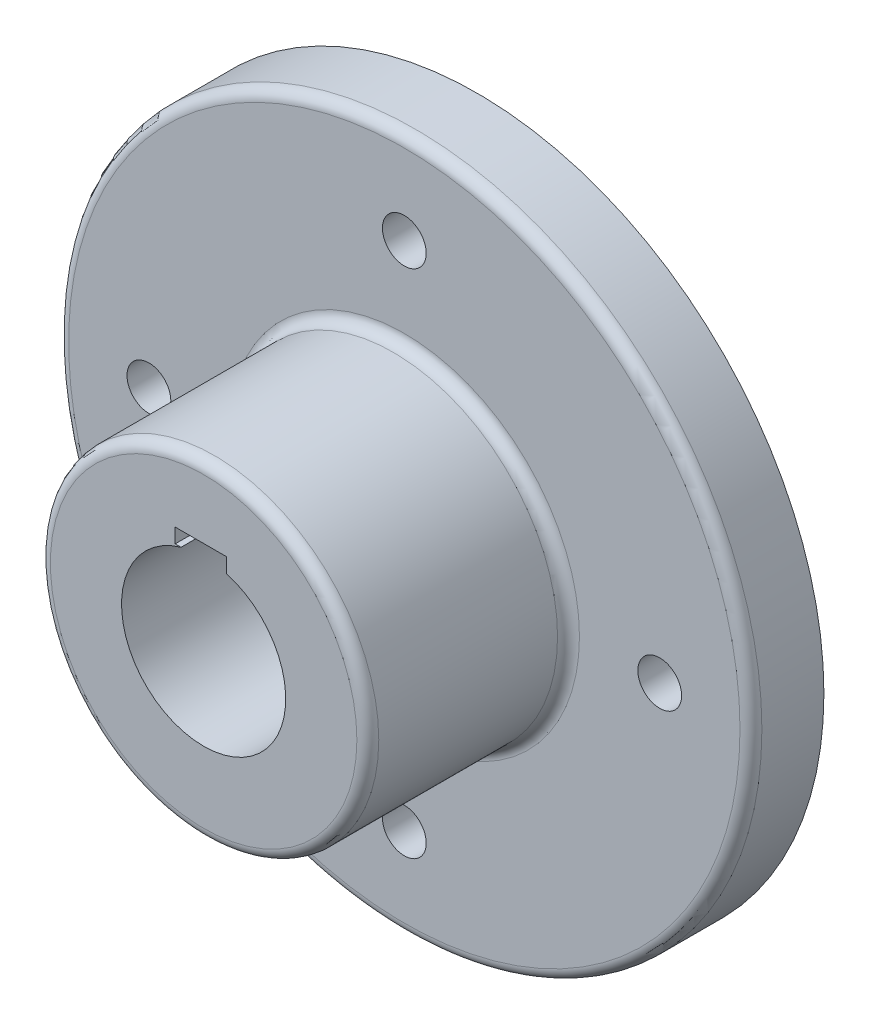
ISO-10303-21;
HEADER;
FILE_DESCRIPTION(('STEP AP214'),'2;1');
FILE_NAME('part.step','',(''),(''),'','','');
FILE_SCHEMA(('AUTOMOTIVE_DESIGN { 1 0 10303 214 1 1 1 1 }'));
ENDSEC;
DATA;
#1=APPLICATION_CONTEXT('core data for automotive mechanical design processes');
#2=APPLICATION_PROTOCOL_DEFINITION('international standard','automotive_design',2000,#1);
#3=PRODUCT_CONTEXT('',#1,'mechanical');
#4=PRODUCT('Part','Part','',(#3));
#5=PRODUCT_RELATED_PRODUCT_CATEGORY('part','',(#4));
#6=PRODUCT_DEFINITION_FORMATION('','',#4);
#7=PRODUCT_DEFINITION_CONTEXT('part definition',#1,'design');
#8=PRODUCT_DEFINITION('design','',#6,#7);
#9=PRODUCT_DEFINITION_SHAPE('','',#8);
#10=(LENGTH_UNIT() NAMED_UNIT(*) SI_UNIT(.MILLI.,.METRE.));
#11=(NAMED_UNIT(*) PLANE_ANGLE_UNIT() SI_UNIT($,.RADIAN.));
#12=(NAMED_UNIT(*) SI_UNIT($,.STERADIAN.) SOLID_ANGLE_UNIT());
#13=UNCERTAINTY_MEASURE_WITH_UNIT(LENGTH_MEASURE(1.E-05),#10,'distance_accuracy_value','');
#14=(GEOMETRIC_REPRESENTATION_CONTEXT(3) GLOBAL_UNCERTAINTY_ASSIGNED_CONTEXT((#13)) GLOBAL_UNIT_ASSIGNED_CONTEXT((#10,
#11,#12)) REPRESENTATION_CONTEXT('',''));
#15=CARTESIAN_POINT('',(0.,0.,0.));
#16=DIRECTION('',(0.,0.,1.));
#17=DIRECTION('',(1.,0.,0.));
#18=AXIS2_PLACEMENT_3D('',#15,#16,#17);
#19=CARTESIAN_POINT('',(0.,0.,20.));
#20=DIRECTION('',(0.,0.,-1.));
#21=DIRECTION('',(-1.,0.,0.));
#22=AXIS2_PLACEMENT_3D('',#19,#20,#21);
#23=CYLINDRICAL_SURFACE('',#22,95.);
#24=CARTESIAN_POINT('',(0.,0.,17.));
#25=DIRECTION('',(0.,0.,1.));
#26=DIRECTION('',(1.,0.,0.));
#27=AXIS2_PLACEMENT_3D('',#24,#25,#26);
#28=CIRCLE('',#27,95.);
#29=CARTESIAN_POINT('',(95.,0.,17.));
#30=VERTEX_POINT('',#29);
#31=EDGE_CURVE('E11',#30,#30,#28,.F.);
#32=ORIENTED_EDGE('',*,*,#31,.T.);
#33=EDGE_LOOP('',(#32));
#34=FACE_BOUND('',#33,.T.);
#35=CARTESIAN_POINT('',(0.,0.,0.));
#36=DIRECTION('',(0.,0.,1.));
#37=DIRECTION('',(1.,0.,0.));
#38=AXIS2_PLACEMENT_3D('',#35,#36,#37);
#39=CIRCLE('',#38,95.);
#40=CARTESIAN_POINT('',(95.,0.,0.));
#41=VERTEX_POINT('',#40);
#42=EDGE_CURVE('E172',#41,#41,#39,.T.);
#43=ORIENTED_EDGE('',*,*,#42,.T.);
#44=EDGE_LOOP('',(#43));
#45=FACE_BOUND('',#44,.T.);
#46=ADVANCED_FACE('F39',(#34,#45),#23,.T.);
#47=CARTESIAN_POINT('',(0.,0.,20.));
#48=DIRECTION('',(0.,0.,1.));
#49=DIRECTION('',(1.,0.,0.));
#50=AXIS2_PLACEMENT_3D('',#47,#48,#49);
#51=PLANE('',#50);
#52=CARTESIAN_POINT('',(0.,0.,20.));
#53=DIRECTION('',(0.,0.,1.));
#54=DIRECTION('',(1.,0.,0.));
#55=AXIS2_PLACEMENT_3D('',#52,#53,#54);
#56=CIRCLE('',#55,48.);
#57=CARTESIAN_POINT('',(48.,0.,20.));
#58=VERTEX_POINT('',#57);
#59=EDGE_CURVE('E48',#58,#58,#56,.F.);
#60=ORIENTED_EDGE('',*,*,#59,.T.);
#61=EDGE_LOOP('',(#60));
#62=FACE_BOUND('',#61,.T.);
#63=CARTESIAN_POINT('',(0.,0.,20.));
#64=DIRECTION('',(0.,0.,1.));
#65=DIRECTION('',(1.,0.,0.));
#66=AXIS2_PLACEMENT_3D('',#63,#64,#65);
#67=CIRCLE('',#66,92.);
#68=CARTESIAN_POINT('',(92.,0.,20.));
#69=VERTEX_POINT('',#68);
#70=EDGE_CURVE('E190',#69,#69,#67,.T.);
#71=ORIENTED_EDGE('',*,*,#70,.T.);
#72=EDGE_LOOP('',(#71));
#73=FACE_BOUND('',#72,.T.);
#74=CARTESIAN_POINT('',(0.,70.,20.));
#75=DIRECTION('',(0.,0.,1.));
#76=DIRECTION('',(1.,0.,0.));
#77=AXIS2_PLACEMENT_3D('',#74,#75,#76);
#78=CIRCLE('',#77,6.);
#79=CARTESIAN_POINT('',(6.,70.,20.));
#80=VERTEX_POINT('',#79);
#81=EDGE_CURVE('E139',#80,#80,#78,.F.);
#82=ORIENTED_EDGE('',*,*,#81,.T.);
#83=EDGE_LOOP('',(#82));
#84=FACE_BOUND('',#83,.T.);
#85=CARTESIAN_POINT('',(-70.000000000002,1.97666086873723E-12,20.));
#86=DIRECTION('',(0.,0.,1.));
#87=DIRECTION('',(1.,0.,0.));
#88=AXIS2_PLACEMENT_3D('',#85,#86,#87);
#89=CIRCLE('',#88,6.00000000000155);
#90=CARTESIAN_POINT('',(-64.0000000000004,1.97666086873723E-12,20.));
#91=VERTEX_POINT('',#90);
#92=EDGE_CURVE('E140',#91,#91,#89,.F.);
#93=ORIENTED_EDGE('',*,*,#92,.T.);
#94=EDGE_LOOP('',(#93));
#95=FACE_BOUND('',#94,.T.);
#96=CARTESIAN_POINT('',(-3.95332173747447E-12,-70.,20.));
#97=DIRECTION('',(0.,0.,1.));
#98=DIRECTION('',(1.,0.,0.));
#99=AXIS2_PLACEMENT_3D('',#96,#97,#98);
#100=CIRCLE('',#99,6.00000000000425);
#101=CARTESIAN_POINT('',(6.0000000000003,-70.,20.));
#102=VERTEX_POINT('',#101);
#103=EDGE_CURVE('E149',#102,#102,#100,.F.);
#104=ORIENTED_EDGE('',*,*,#103,.T.);
#105=EDGE_LOOP('',(#104));
#106=FACE_BOUND('',#105,.T.);
#107=CARTESIAN_POINT('',(69.999999999998,-1.98523339633126E-12,20.));
#108=DIRECTION('',(0.,0.,1.));
#109=DIRECTION('',(1.,0.,0.));
#110=AXIS2_PLACEMENT_3D('',#107,#108,#109);
#111=CIRCLE('',#110,6.00000000000318);
#112=CARTESIAN_POINT('',(76.0000000000012,-1.98523339633126E-12,20.));
#113=VERTEX_POINT('',#112);
#114=EDGE_CURVE('E157',#113,#113,#111,.F.);
#115=ORIENTED_EDGE('',*,*,#114,.T.);
#116=EDGE_LOOP('',(#115));
#117=FACE_BOUND('',#116,.T.);
#118=ADVANCED_FACE('F197',(#62,#73,#84,#95,#106,#117),#51,.T.);
#119=CARTESIAN_POINT('',(0.,0.,0.));
#120=DIRECTION('',(0.,0.,1.));
#121=DIRECTION('',(1.,0.,0.));
#122=AXIS2_PLACEMENT_3D('',#119,#120,#121);
#123=PLANE('',#122);
#124=CARTESIAN_POINT('',(0.,70.,0.));
#125=DIRECTION('',(0.,0.,-1.));
#126=DIRECTION('',(-1.,0.,0.));
#127=AXIS2_PLACEMENT_3D('',#124,#125,#126);
#128=CIRCLE('',#127,6.);
#129=CARTESIAN_POINT('',(-6.,70.,0.));
#130=VERTEX_POINT('',#129);
#131=EDGE_CURVE('E135',#130,#130,#128,.T.);
#132=ORIENTED_EDGE('',*,*,#131,.F.);
#133=EDGE_LOOP('',(#132));
#134=FACE_BOUND('',#133,.T.);
#135=CARTESIAN_POINT('',(-70.000000000002,1.97666086873723E-12,0.));
#136=DIRECTION('',(0.,0.,-1.));
#137=DIRECTION('',(-1.,0.,0.));
#138=AXIS2_PLACEMENT_3D('',#135,#136,#137);
#139=CIRCLE('',#138,6.00000000000155);
#140=CARTESIAN_POINT('',(-76.0000000000035,1.97666086873723E-12,0.));
#141=VERTEX_POINT('',#140);
#142=EDGE_CURVE('E145',#141,#141,#139,.T.);
#143=ORIENTED_EDGE('',*,*,#142,.F.);
#144=EDGE_LOOP('',(#143));
#145=FACE_BOUND('',#144,.T.);
#146=CARTESIAN_POINT('',(-3.95332173747447E-12,-70.,0.));
#147=DIRECTION('',(0.,0.,-1.));
#148=DIRECTION('',(-1.,0.,0.));
#149=AXIS2_PLACEMENT_3D('',#146,#147,#148);
#150=CIRCLE('',#149,6.00000000000425);
#151=CARTESIAN_POINT('',(-6.0000000000082,-70.,0.));
#152=VERTEX_POINT('',#151);
#153=EDGE_CURVE('E153',#152,#152,#150,.T.);
#154=ORIENTED_EDGE('',*,*,#153,.F.);
#155=EDGE_LOOP('',(#154));
#156=FACE_BOUND('',#155,.T.);
#157=CARTESIAN_POINT('',(69.999999999998,-1.98523339633126E-12,0.));
#158=DIRECTION('',(0.,0.,-1.));
#159=DIRECTION('',(-1.,0.,0.));
#160=AXIS2_PLACEMENT_3D('',#157,#158,#159);
#161=CIRCLE('',#160,6.00000000000318);
#162=CARTESIAN_POINT('',(63.9999999999949,-1.98523339633126E-12,0.));
#163=VERTEX_POINT('',#162);
#164=EDGE_CURVE('E134',#163,#163,#161,.T.);
#165=ORIENTED_EDGE('',*,*,#164,.F.);
#166=EDGE_LOOP('',(#165));
#167=FACE_BOUND('',#166,.T.);
#168=DIRECTION('',(0.,1.,0.));
#169=VECTOR('',#168,1.);
#170=CARTESIAN_POINT('',(-7.8016616704134,21.6293920846606,0.));
#171=LINE('',#170,#169);
#172=CARTESIAN_POINT('',(-7.8016616704134,21.6293920846606,0.));
#173=VERTEX_POINT('',#172);
#174=CARTESIAN_POINT('',(-7.8016616704134,25.6293920846606,0.));
#175=VERTEX_POINT('',#174);
#176=EDGE_CURVE('E115',#173,#175,#171,.T.);
#177=ORIENTED_EDGE('',*,*,#176,.F.);
#178=DIRECTION('',(-1.,0.,0.));
#179=VECTOR('',#178,1.);
#180=CARTESIAN_POINT('',(6.1983383295866,21.6293920846606,0.));
#181=LINE('',#180,#179);
#182=CARTESIAN_POINT('',(-6.1983383295866,21.6293920846606,0.));
#183=VERTEX_POINT('',#182);
#184=EDGE_CURVE('E102',#183,#173,#181,.T.);
#185=ORIENTED_EDGE('',*,*,#184,.F.);
#186=CARTESIAN_POINT('',(0.,0.,0.));
#187=DIRECTION('',(0.,0.,-1.));
#188=DIRECTION('',(-1.,0.,0.));
#189=AXIS2_PLACEMENT_3D('',#186,#187,#188);
#190=CIRCLE('',#189,22.5);
#191=CARTESIAN_POINT('',(6.1983383295866,21.6293920846606,0.));
#192=VERTEX_POINT('',#191);
#193=EDGE_CURVE('E144',#192,#183,#190,.T.);
#194=ORIENTED_EDGE('',*,*,#193,.F.);
#195=DIRECTION('',(0.,-1.,0.));
#196=VECTOR('',#195,1.);
#197=CARTESIAN_POINT('',(6.1983383295866,21.6293920846606,0.));
#198=LINE('',#197,#196);
#199=CARTESIAN_POINT('',(6.1983383295866,25.6293920846606,0.));
#200=VERTEX_POINT('',#199);
#201=EDGE_CURVE('E55',#200,#192,#198,.T.);
#202=ORIENTED_EDGE('',*,*,#201,.F.);
#203=DIRECTION('',(1.,0.,0.));
#204=VECTOR('',#203,1.);
#205=CARTESIAN_POINT('',(6.1983383295866,25.6293920846606,0.));
#206=LINE('',#205,#204);
#207=EDGE_CURVE('E111',#175,#200,#206,.T.);
#208=ORIENTED_EDGE('',*,*,#207,.F.);
#209=EDGE_LOOP('',(#177,#185,#194,#202,#208));
#210=FACE_BOUND('',#209,.T.);
#211=ORIENTED_EDGE('',*,*,#42,.F.);
#212=EDGE_LOOP('',(#211));
#213=FACE_BOUND('',#212,.T.);
#214=ADVANCED_FACE('F208',(#134,#145,#156,#167,#210,#213),#123,.F.);
#215=CARTESIAN_POINT('',(0.,0.,75.));
#216=DIRECTION('',(0.,0.,-1.));
#217=DIRECTION('',(-1.,0.,0.));
#218=AXIS2_PLACEMENT_3D('',#215,#216,#217);
#219=CYLINDRICAL_SURFACE('',#218,45.);
#220=CARTESIAN_POINT('',(0.,0.,72.));
#221=DIRECTION('',(0.,0.,1.));
#222=DIRECTION('',(1.,0.,0.));
#223=AXIS2_PLACEMENT_3D('',#220,#221,#222);
#224=CIRCLE('',#223,45.);
#225=CARTESIAN_POINT('',(45.,0.,72.));
#226=VERTEX_POINT('',#225);
#227=EDGE_CURVE('E186',#226,#226,#224,.F.);
#228=ORIENTED_EDGE('',*,*,#227,.T.);
#229=EDGE_LOOP('',(#228));
#230=FACE_BOUND('',#229,.T.);
#231=CARTESIAN_POINT('',(0.,0.,23.));
#232=DIRECTION('',(0.,0.,1.));
#233=DIRECTION('',(1.,0.,0.));
#234=AXIS2_PLACEMENT_3D('',#231,#232,#233);
#235=CIRCLE('',#234,45.);
#236=CARTESIAN_POINT('',(45.,0.,23.));
#237=VERTEX_POINT('',#236);
#238=EDGE_CURVE('E182',#237,#237,#235,.T.);
#239=ORIENTED_EDGE('',*,*,#238,.T.);
#240=EDGE_LOOP('',(#239));
#241=FACE_BOUND('',#240,.T.);
#242=ADVANCED_FACE('F206',(#230,#241),#219,.T.);
#243=CARTESIAN_POINT('',(0.,0.,75.));
#244=DIRECTION('',(0.,0.,1.));
#245=DIRECTION('',(1.,0.,0.));
#246=AXIS2_PLACEMENT_3D('',#243,#244,#245);
#247=PLANE('',#246);
#248=CARTESIAN_POINT('',(0.,0.,75.));
#249=DIRECTION('',(0.,0.,1.));
#250=DIRECTION('',(1.,0.,0.));
#251=AXIS2_PLACEMENT_3D('',#248,#249,#250);
#252=CIRCLE('',#251,42.);
#253=CARTESIAN_POINT('',(42.,0.,75.));
#254=VERTEX_POINT('',#253);
#255=EDGE_CURVE('E178',#254,#254,#252,.T.);
#256=ORIENTED_EDGE('',*,*,#255,.T.);
#257=EDGE_LOOP('',(#256));
#258=FACE_BOUND('',#257,.T.);
#259=DIRECTION('',(-1.,0.,0.));
#260=VECTOR('',#259,1.);
#261=CARTESIAN_POINT('',(6.1983383295866,21.6293920846606,75.));
#262=LINE('',#261,#260);
#263=CARTESIAN_POINT('',(-6.1983383295866,21.6293920846606,75.));
#264=VERTEX_POINT('',#263);
#265=CARTESIAN_POINT('',(-7.8016616704134,21.6293920846606,75.));
#266=VERTEX_POINT('',#265);
#267=EDGE_CURVE('E101',#264,#266,#262,.T.);
#268=ORIENTED_EDGE('',*,*,#267,.T.);
#269=DIRECTION('',(0.,1.,0.));
#270=VECTOR('',#269,1.);
#271=CARTESIAN_POINT('',(-7.8016616704134,21.6293920846606,75.));
#272=LINE('',#271,#270);
#273=CARTESIAN_POINT('',(-7.8016616704134,25.6293920846606,75.));
#274=VERTEX_POINT('',#273);
#275=EDGE_CURVE('E88',#266,#274,#272,.T.);
#276=ORIENTED_EDGE('',*,*,#275,.T.);
#277=DIRECTION('',(1.,0.,0.));
#278=VECTOR('',#277,1.);
#279=CARTESIAN_POINT('',(6.1983383295866,25.6293920846606,75.));
#280=LINE('',#279,#278);
#281=CARTESIAN_POINT('',(6.1983383295866,25.6293920846606,75.));
#282=VERTEX_POINT('',#281);
#283=EDGE_CURVE('E125',#274,#282,#280,.T.);
#284=ORIENTED_EDGE('',*,*,#283,.T.);
#285=DIRECTION('',(0.,-1.,0.));
#286=VECTOR('',#285,1.);
#287=CARTESIAN_POINT('',(6.1983383295866,21.6293920846606,75.));
#288=LINE('',#287,#286);
#289=CARTESIAN_POINT('',(6.1983383295866,21.6293920846606,75.));
#290=VERTEX_POINT('',#289);
#291=EDGE_CURVE('E120',#282,#290,#288,.T.);
#292=ORIENTED_EDGE('',*,*,#291,.T.);
#293=CARTESIAN_POINT('',(0.,0.,75.));
#294=DIRECTION('',(0.,0.,1.));
#295=DIRECTION('',(1.,0.,0.));
#296=AXIS2_PLACEMENT_3D('',#293,#294,#295);
#297=CIRCLE('',#296,22.5);
#298=EDGE_CURVE('E109',#290,#264,#297,.F.);
#299=ORIENTED_EDGE('',*,*,#298,.T.);
#300=EDGE_LOOP('',(#268,#276,#284,#292,#299));
#301=FACE_BOUND('',#300,.T.);
#302=ADVANCED_FACE('F106',(#258,#301),#247,.T.);
#303=CARTESIAN_POINT('',(0.,0.,138.639610306789));
#304=DIRECTION('',(0.,0.,-1.));
#305=DIRECTION('',(-1.,0.,0.));
#306=AXIS2_PLACEMENT_3D('',#303,#304,#305);
#307=CYLINDRICAL_SURFACE('',#306,22.5);
#308=ORIENTED_EDGE('',*,*,#193,.T.);
#309=DIRECTION('',(0.,0.,-1.));
#310=VECTOR('',#309,1.);
#311=CARTESIAN_POINT('',(-6.1983383295866,21.6293920846606,138.639610306789));
#312=LINE('',#311,#310);
#313=EDGE_CURVE('E63',#183,#264,#312,.F.);
#314=ORIENTED_EDGE('',*,*,#313,.T.);
#315=ORIENTED_EDGE('',*,*,#298,.F.);
#316=DIRECTION('',(0.,0.,-1.));
#317=VECTOR('',#316,1.);
#318=CARTESIAN_POINT('',(6.1983383295866,21.6293920846606,89.560219778561));
#319=LINE('',#318,#317);
#320=EDGE_CURVE('E123',#290,#192,#319,.T.);
#321=ORIENTED_EDGE('',*,*,#320,.T.);
#322=EDGE_LOOP('',(#308,#314,#315,#321));
#323=FACE_BOUND('',#322,.T.);
#324=ADVANCED_FACE('F215',(#323),#307,.F.);
#325=CARTESIAN_POINT('',(69.999999999998,-1.98523339633126E-12,36.9705627484892));
#326=DIRECTION('',(0.,0.,-1.));
#327=DIRECTION('',(-1.,0.,0.));
#328=AXIS2_PLACEMENT_3D('',#325,#326,#327);
#329=CYLINDRICAL_SURFACE('',#328,6.00000000000318);
#330=ORIENTED_EDGE('',*,*,#164,.T.);
#331=EDGE_LOOP('',(#330));
#332=FACE_BOUND('',#331,.T.);
#333=ORIENTED_EDGE('',*,*,#114,.F.);
#334=EDGE_LOOP('',(#333));
#335=FACE_BOUND('',#334,.T.);
#336=ADVANCED_FACE('F261',(#332,#335),#329,.F.);
#337=CARTESIAN_POINT('',(-3.95332173747447E-12,-70.,36.9705627484892));
#338=DIRECTION('',(0.,0.,-1.));
#339=DIRECTION('',(-1.,0.,0.));
#340=AXIS2_PLACEMENT_3D('',#337,#338,#339);
#341=CYLINDRICAL_SURFACE('',#340,6.00000000000425);
#342=ORIENTED_EDGE('',*,*,#153,.T.);
#343=EDGE_LOOP('',(#342));
#344=FACE_BOUND('',#343,.T.);
#345=ORIENTED_EDGE('',*,*,#103,.F.);
#346=EDGE_LOOP('',(#345));
#347=FACE_BOUND('',#346,.T.);
#348=ADVANCED_FACE('F257',(#344,#347),#341,.F.);
#349=CARTESIAN_POINT('',(-70.000000000002,1.97666086873723E-12,36.9705627484892));
#350=DIRECTION('',(0.,0.,-1.));
#351=DIRECTION('',(-1.,0.,0.));
#352=AXIS2_PLACEMENT_3D('',#349,#350,#351);
#353=CYLINDRICAL_SURFACE('',#352,6.00000000000155);
#354=ORIENTED_EDGE('',*,*,#142,.T.);
#355=EDGE_LOOP('',(#354));
#356=FACE_BOUND('',#355,.T.);
#357=ORIENTED_EDGE('',*,*,#92,.F.);
#358=EDGE_LOOP('',(#357));
#359=FACE_BOUND('',#358,.T.);
#360=ADVANCED_FACE('F253',(#356,#359),#353,.F.);
#361=CARTESIAN_POINT('',(0.,70.,36.9705627484892));
#362=DIRECTION('',(0.,0.,-1.));
#363=DIRECTION('',(-1.,0.,0.));
#364=AXIS2_PLACEMENT_3D('',#361,#362,#363);
#365=CYLINDRICAL_SURFACE('',#364,6.);
#366=ORIENTED_EDGE('',*,*,#131,.T.);
#367=EDGE_LOOP('',(#366));
#368=FACE_BOUND('',#367,.T.);
#369=ORIENTED_EDGE('',*,*,#81,.F.);
#370=EDGE_LOOP('',(#369));
#371=FACE_BOUND('',#370,.T.);
#372=ADVANCED_FACE('F250',(#368,#371),#365,.F.);
#373=CARTESIAN_POINT('',(6.1983383295866,21.6293920846606,89.560219778561));
#374=DIRECTION('',(0.,-1.,0.));
#375=DIRECTION('',(0.,0.,-1.));
#376=AXIS2_PLACEMENT_3D('',#373,#374,#375);
#377=PLANE('',#376);
#378=ORIENTED_EDGE('',*,*,#184,.T.);
#379=DIRECTION('',(0.,0.,-1.));
#380=VECTOR('',#379,1.);
#381=CARTESIAN_POINT('',(-7.8016616704134,21.6293920846606,89.560219778561));
#382=LINE('',#381,#380);
#383=EDGE_CURVE('E92',#266,#173,#382,.T.);
#384=ORIENTED_EDGE('',*,*,#383,.F.);
#385=ORIENTED_EDGE('',*,*,#267,.F.);
#386=ORIENTED_EDGE('',*,*,#313,.F.);
#387=EDGE_LOOP('',(#378,#384,#385,#386));
#388=FACE_BOUND('',#387,.T.);
#389=ADVANCED_FACE('F100',(#388),#377,.F.);
#390=CARTESIAN_POINT('',(-7.8016616704134,21.6293920846606,89.560219778561));
#391=DIRECTION('',(-1.,0.,0.));
#392=DIRECTION('',(0.,0.,1.));
#393=AXIS2_PLACEMENT_3D('',#390,#391,#392);
#394=PLANE('',#393);
#395=ORIENTED_EDGE('',*,*,#383,.T.);
#396=ORIENTED_EDGE('',*,*,#176,.T.);
#397=DIRECTION('',(0.,0.,-1.));
#398=VECTOR('',#397,1.);
#399=CARTESIAN_POINT('',(-7.8016616704134,25.6293920846606,89.560219778561));
#400=LINE('',#399,#398);
#401=EDGE_CURVE('E94',#274,#175,#400,.T.);
#402=ORIENTED_EDGE('',*,*,#401,.F.);
#403=ORIENTED_EDGE('',*,*,#275,.F.);
#404=EDGE_LOOP('',(#395,#396,#402,#403));
#405=FACE_BOUND('',#404,.T.);
#406=ADVANCED_FACE('F90',(#405),#394,.F.);
#407=CARTESIAN_POINT('',(6.1983383295866,25.6293920846606,89.560219778561));
#408=DIRECTION('',(0.,1.,0.));
#409=DIRECTION('',(0.,0.,1.));
#410=AXIS2_PLACEMENT_3D('',#407,#408,#409);
#411=PLANE('',#410);
#412=ORIENTED_EDGE('',*,*,#401,.T.);
#413=ORIENTED_EDGE('',*,*,#207,.T.);
#414=DIRECTION('',(0.,0.,-1.));
#415=VECTOR('',#414,1.);
#416=CARTESIAN_POINT('',(6.1983383295866,25.6293920846606,89.560219778561));
#417=LINE('',#416,#415);
#418=EDGE_CURVE('E124',#282,#200,#417,.T.);
#419=ORIENTED_EDGE('',*,*,#418,.F.);
#420=ORIENTED_EDGE('',*,*,#283,.F.);
#421=EDGE_LOOP('',(#412,#413,#419,#420));
#422=FACE_BOUND('',#421,.T.);
#423=ADVANCED_FACE('F235',(#422),#411,.F.);
#424=CARTESIAN_POINT('',(6.1983383295866,21.6293920846606,89.560219778561));
#425=DIRECTION('',(1.,0.,0.));
#426=DIRECTION('',(0.,0.,-1.));
#427=AXIS2_PLACEMENT_3D('',#424,#425,#426);
#428=PLANE('',#427);
#429=ORIENTED_EDGE('',*,*,#418,.T.);
#430=ORIENTED_EDGE('',*,*,#201,.T.);
#431=ORIENTED_EDGE('',*,*,#320,.F.);
#432=ORIENTED_EDGE('',*,*,#291,.F.);
#433=EDGE_LOOP('',(#429,#430,#431,#432));
#434=FACE_BOUND('',#433,.T.);
#435=ADVANCED_FACE('F230',(#434),#428,.F.);
#436=CARTESIAN_POINT('',(0.,0.,72.));
#437=DIRECTION('',(0.,0.,1.));
#438=DIRECTION('',(1.,0.,0.));
#439=AXIS2_PLACEMENT_3D('',#436,#437,#438);
#440=TOROIDAL_SURFACE('',#439,42.,3.);
#441=ORIENTED_EDGE('',*,*,#227,.F.);
#442=EDGE_LOOP('',(#441));
#443=FACE_BOUND('',#442,.T.);
#444=ORIENTED_EDGE('',*,*,#255,.F.);
#445=EDGE_LOOP('',(#444));
#446=FACE_BOUND('',#445,.T.);
#447=ADVANCED_FACE('F203',(#443,#446),#440,.T.);
#448=CARTESIAN_POINT('',(0.,0.,23.));
#449=DIRECTION('',(0.,0.,1.));
#450=DIRECTION('',(1.,0.,0.));
#451=AXIS2_PLACEMENT_3D('',#448,#449,#450);
#452=TOROIDAL_SURFACE('',#451,48.,3.);
#453=ORIENTED_EDGE('',*,*,#59,.F.);
#454=EDGE_LOOP('',(#453));
#455=FACE_BOUND('',#454,.T.);
#456=ORIENTED_EDGE('',*,*,#238,.F.);
#457=EDGE_LOOP('',(#456));
#458=FACE_BOUND('',#457,.T.);
#459=ADVANCED_FACE('F200',(#455,#458),#452,.F.);
#460=CARTESIAN_POINT('',(0.,0.,17.));
#461=DIRECTION('',(0.,0.,1.));
#462=DIRECTION('',(1.,0.,0.));
#463=AXIS2_PLACEMENT_3D('',#460,#461,#462);
#464=TOROIDAL_SURFACE('',#463,92.,3.);
#465=ORIENTED_EDGE('',*,*,#31,.F.);
#466=EDGE_LOOP('',(#465));
#467=FACE_BOUND('',#466,.T.);
#468=ORIENTED_EDGE('',*,*,#70,.F.);
#469=EDGE_LOOP('',(#468));
#470=FACE_BOUND('',#469,.T.);
#471=ADVANCED_FACE('F41',(#467,#470),#464,.T.);
#472=CLOSED_SHELL('',(#46,#118,#214,#242,#302,#324,#336,#348,#360,#372,#389,#406,#423,#435,#447,
#459,#471));
#473=MANIFOLD_SOLID_BREP('B2',#472);
#474=ADVANCED_BREP_SHAPE_REPRESENTATION('',(#18,#473),#14);
#475=SHAPE_DEFINITION_REPRESENTATION(#9,#474);
ENDSEC;
END-ISO-10303-21;
